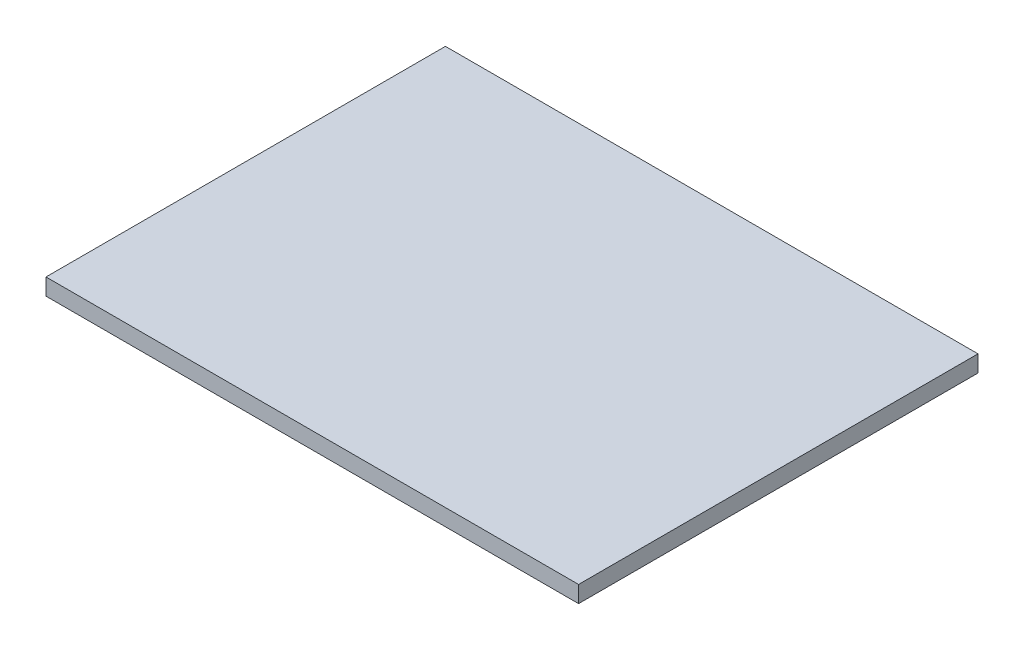
ISO-10303-21;
HEADER;
FILE_DESCRIPTION(('STEP AP214'),'2;1');
FILE_NAME('part.step','',(''),(''),'','','');
FILE_SCHEMA(('AUTOMOTIVE_DESIGN { 1 0 10303 214 1 1 1 1 }'));
ENDSEC;
DATA;
#1=APPLICATION_CONTEXT('core data for automotive mechanical design processes');
#2=APPLICATION_PROTOCOL_DEFINITION('international standard','automotive_design',2000,#1);
#3=PRODUCT_CONTEXT('',#1,'mechanical');
#4=PRODUCT('Part','Part','',(#3));
#5=PRODUCT_RELATED_PRODUCT_CATEGORY('part','',(#4));
#6=PRODUCT_DEFINITION_FORMATION('','',#4);
#7=PRODUCT_DEFINITION_CONTEXT('part definition',#1,'design');
#8=PRODUCT_DEFINITION('design','',#6,#7);
#9=PRODUCT_DEFINITION_SHAPE('','',#8);
#10=(LENGTH_UNIT() NAMED_UNIT(*) SI_UNIT(.MILLI.,.METRE.));
#11=(NAMED_UNIT(*) PLANE_ANGLE_UNIT() SI_UNIT($,.RADIAN.));
#12=(NAMED_UNIT(*) SI_UNIT($,.STERADIAN.) SOLID_ANGLE_UNIT());
#13=UNCERTAINTY_MEASURE_WITH_UNIT(LENGTH_MEASURE(1.E-05),#10,'distance_accuracy_value','');
#14=(GEOMETRIC_REPRESENTATION_CONTEXT(3) GLOBAL_UNCERTAINTY_ASSIGNED_CONTEXT((#13)) GLOBAL_UNIT_ASSIGNED_CONTEXT((#10,
#11,#12)) REPRESENTATION_CONTEXT('',''));
#15=CARTESIAN_POINT('',(0.,0.,0.));
#16=DIRECTION('',(0.,0.,1.));
#17=DIRECTION('',(1.,0.,0.));
#18=AXIS2_PLACEMENT_3D('',#15,#16,#17);
#19=CARTESIAN_POINT('',(203.2,12.7,-152.4));
#20=DIRECTION('',(-1.,0.,0.));
#21=DIRECTION('',(0.,0.,1.));
#22=AXIS2_PLACEMENT_3D('',#19,#20,#21);
#23=PLANE('',#22);
#24=DIRECTION('',(0.,0.,-1.));
#25=VECTOR('',#24,1.);
#26=CARTESIAN_POINT('',(203.2,0.,-152.4));
#27=LINE('',#26,#25);
#28=CARTESIAN_POINT('',(203.2,0.,152.4));
#29=VERTEX_POINT('',#28);
#30=CARTESIAN_POINT('',(203.2,0.,-152.4));
#31=VERTEX_POINT('',#30);
#32=EDGE_CURVE('E102',#29,#31,#27,.T.);
#33=ORIENTED_EDGE('',*,*,#32,.T.);
#34=DIRECTION('',(0.,-1.,0.));
#35=VECTOR('',#34,1.);
#36=CARTESIAN_POINT('',(203.2,12.7,-152.4));
#37=LINE('',#36,#35);
#38=CARTESIAN_POINT('',(203.2,12.7,-152.4));
#39=VERTEX_POINT('',#38);
#40=EDGE_CURVE('E11',#39,#31,#37,.T.);
#41=ORIENTED_EDGE('',*,*,#40,.F.);
#42=DIRECTION('',(0.,0.,-1.));
#43=VECTOR('',#42,1.);
#44=CARTESIAN_POINT('',(203.2,12.7,-152.4));
#45=LINE('',#44,#43);
#46=CARTESIAN_POINT('',(203.2,12.7,152.4));
#47=VERTEX_POINT('',#46);
#48=EDGE_CURVE('E90',#47,#39,#45,.T.);
#49=ORIENTED_EDGE('',*,*,#48,.F.);
#50=DIRECTION('',(0.,-1.,0.));
#51=VECTOR('',#50,1.);
#52=CARTESIAN_POINT('',(203.2,12.7,152.4));
#53=LINE('',#52,#51);
#54=EDGE_CURVE('E98',#47,#29,#53,.T.);
#55=ORIENTED_EDGE('',*,*,#54,.T.);
#56=EDGE_LOOP('',(#33,#41,#49,#55));
#57=FACE_BOUND('',#56,.T.);
#58=ADVANCED_FACE('F39',(#57),#23,.F.);
#59=CARTESIAN_POINT('',(-203.2,12.7,-152.4));
#60=DIRECTION('',(0.,0.,1.));
#61=DIRECTION('',(1.,0.,0.));
#62=AXIS2_PLACEMENT_3D('',#59,#60,#61);
#63=PLANE('',#62);
#64=DIRECTION('',(-1.,0.,0.));
#65=VECTOR('',#64,1.);
#66=CARTESIAN_POINT('',(-203.2,0.,-152.4));
#67=LINE('',#66,#65);
#68=CARTESIAN_POINT('',(-203.2,0.,-152.4));
#69=VERTEX_POINT('',#68);
#70=EDGE_CURVE('E94',#31,#69,#67,.T.);
#71=ORIENTED_EDGE('',*,*,#70,.T.);
#72=DIRECTION('',(0.,-1.,0.));
#73=VECTOR('',#72,1.);
#74=CARTESIAN_POINT('',(-203.2,12.7,-152.4));
#75=LINE('',#74,#73);
#76=CARTESIAN_POINT('',(-203.2,12.7,-152.4));
#77=VERTEX_POINT('',#76);
#78=EDGE_CURVE('E47',#77,#69,#75,.T.);
#79=ORIENTED_EDGE('',*,*,#78,.F.);
#80=DIRECTION('',(-1.,0.,0.));
#81=VECTOR('',#80,1.);
#82=CARTESIAN_POINT('',(-203.2,12.7,-152.4));
#83=LINE('',#82,#81);
#84=EDGE_CURVE('E85',#39,#77,#83,.T.);
#85=ORIENTED_EDGE('',*,*,#84,.F.);
#86=ORIENTED_EDGE('',*,*,#40,.T.);
#87=EDGE_LOOP('',(#71,#79,#85,#86));
#88=FACE_BOUND('',#87,.T.);
#89=ADVANCED_FACE('F93',(#88),#63,.F.);
#90=CARTESIAN_POINT('',(-203.2,12.7,-152.4));
#91=DIRECTION('',(1.,0.,0.));
#92=DIRECTION('',(0.,0.,-1.));
#93=AXIS2_PLACEMENT_3D('',#90,#91,#92);
#94=PLANE('',#93);
#95=DIRECTION('',(0.,0.,1.));
#96=VECTOR('',#95,1.);
#97=CARTESIAN_POINT('',(-203.2,0.,-152.4));
#98=LINE('',#97,#96);
#99=CARTESIAN_POINT('',(-203.2,0.,152.4));
#100=VERTEX_POINT('',#99);
#101=EDGE_CURVE('E72',#69,#100,#98,.T.);
#102=ORIENTED_EDGE('',*,*,#101,.T.);
#103=DIRECTION('',(0.,-1.,0.));
#104=VECTOR('',#103,1.);
#105=CARTESIAN_POINT('',(-203.2,12.7,152.4));
#106=LINE('',#105,#104);
#107=CARTESIAN_POINT('',(-203.2,12.7,152.4));
#108=VERTEX_POINT('',#107);
#109=EDGE_CURVE('E95',#108,#100,#106,.T.);
#110=ORIENTED_EDGE('',*,*,#109,.F.);
#111=DIRECTION('',(0.,0.,1.));
#112=VECTOR('',#111,1.);
#113=CARTESIAN_POINT('',(-203.2,12.7,-152.4));
#114=LINE('',#113,#112);
#115=EDGE_CURVE('E88',#77,#108,#114,.T.);
#116=ORIENTED_EDGE('',*,*,#115,.F.);
#117=ORIENTED_EDGE('',*,*,#78,.T.);
#118=EDGE_LOOP('',(#102,#110,#116,#117));
#119=FACE_BOUND('',#118,.T.);
#120=ADVANCED_FACE('F96',(#119),#94,.F.);
#121=CARTESIAN_POINT('',(-203.2,12.7,152.4));
#122=DIRECTION('',(0.,0.,-1.));
#123=DIRECTION('',(-1.,0.,0.));
#124=AXIS2_PLACEMENT_3D('',#121,#122,#123);
#125=PLANE('',#124);
#126=DIRECTION('',(1.,0.,0.));
#127=VECTOR('',#126,1.);
#128=CARTESIAN_POINT('',(-203.2,0.,152.4));
#129=LINE('',#128,#127);
#130=EDGE_CURVE('E78',#100,#29,#129,.T.);
#131=ORIENTED_EDGE('',*,*,#130,.T.);
#132=ORIENTED_EDGE('',*,*,#54,.F.);
#133=DIRECTION('',(1.,0.,0.));
#134=VECTOR('',#133,1.);
#135=CARTESIAN_POINT('',(-203.2,12.7,152.4));
#136=LINE('',#135,#134);
#137=EDGE_CURVE('E55',#108,#47,#136,.T.);
#138=ORIENTED_EDGE('',*,*,#137,.F.);
#139=ORIENTED_EDGE('',*,*,#109,.T.);
#140=EDGE_LOOP('',(#131,#132,#138,#139));
#141=FACE_BOUND('',#140,.T.);
#142=ADVANCED_FACE('F109',(#141),#125,.F.);
#143=CARTESIAN_POINT('',(0.,12.7,0.));
#144=DIRECTION('',(0.,1.,0.));
#145=DIRECTION('',(0.,0.,1.));
#146=AXIS2_PLACEMENT_3D('',#143,#144,#145);
#147=PLANE('',#146);
#148=ORIENTED_EDGE('',*,*,#48,.T.);
#149=ORIENTED_EDGE('',*,*,#84,.T.);
#150=ORIENTED_EDGE('',*,*,#115,.T.);
#151=ORIENTED_EDGE('',*,*,#137,.T.);
#152=EDGE_LOOP('',(#148,#149,#150,#151));
#153=FACE_BOUND('',#152,.T.);
#154=ADVANCED_FACE('F86',(#153),#147,.T.);
#155=CARTESIAN_POINT('',(0.,0.,0.));
#156=DIRECTION('',(0.,1.,0.));
#157=DIRECTION('',(0.,0.,1.));
#158=AXIS2_PLACEMENT_3D('',#155,#156,#157);
#159=PLANE('',#158);
#160=ORIENTED_EDGE('',*,*,#32,.F.);
#161=ORIENTED_EDGE('',*,*,#130,.F.);
#162=ORIENTED_EDGE('',*,*,#101,.F.);
#163=ORIENTED_EDGE('',*,*,#70,.F.);
#164=EDGE_LOOP('',(#160,#161,#162,#163));
#165=FACE_BOUND('',#164,.T.);
#166=ADVANCED_FACE('F112',(#165),#159,.F.);
#167=CLOSED_SHELL('',(#58,#89,#120,#142,#154,#166));
#168=MANIFOLD_SOLID_BREP('B2',#167);
#169=ADVANCED_BREP_SHAPE_REPRESENTATION('',(#18,#168),#14);
#170=SHAPE_DEFINITION_REPRESENTATION(#9,#169);
ENDSEC;
END-ISO-10303-21;
